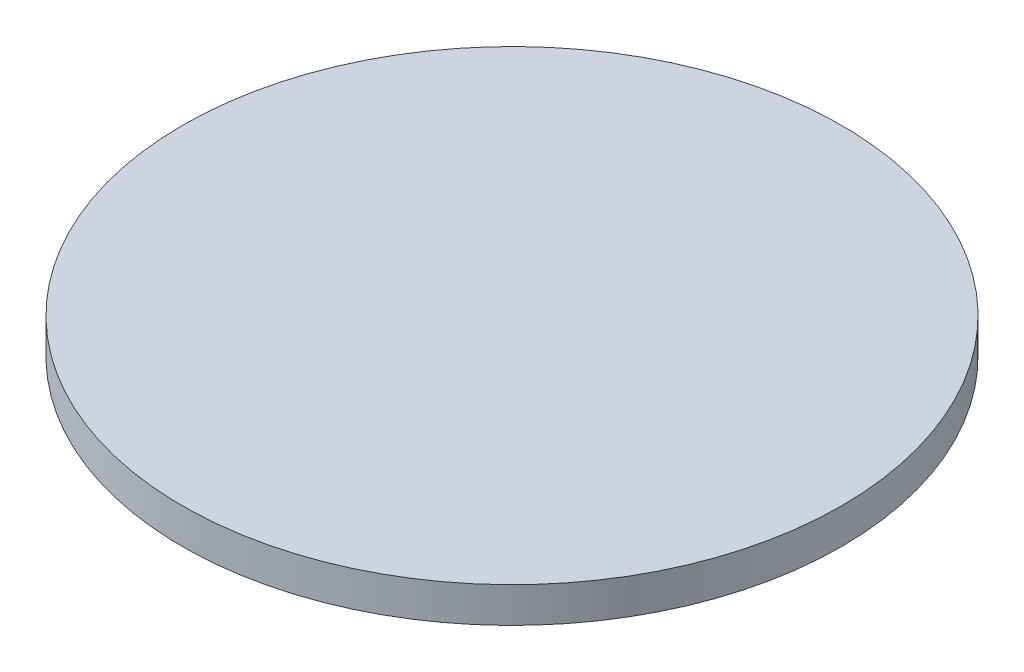
ISO-10303-21;
HEADER;
FILE_DESCRIPTION(('STEP AP214'),'2;1');
FILE_NAME('part.step','',(''),(''),'','','');
FILE_SCHEMA(('AUTOMOTIVE_DESIGN { 1 0 10303 214 1 1 1 1 }'));
ENDSEC;
DATA;
#1=APPLICATION_CONTEXT('core data for automotive mechanical design processes');
#2=APPLICATION_PROTOCOL_DEFINITION('international standard','automotive_design',2000,#1);
#3=PRODUCT_CONTEXT('',#1,'mechanical');
#4=PRODUCT('Part','Part','',(#3));
#5=PRODUCT_RELATED_PRODUCT_CATEGORY('part','',(#4));
#6=PRODUCT_DEFINITION_FORMATION('','',#4);
#7=PRODUCT_DEFINITION_CONTEXT('part definition',#1,'design');
#8=PRODUCT_DEFINITION('design','',#6,#7);
#9=PRODUCT_DEFINITION_SHAPE('','',#8);
#10=(LENGTH_UNIT() NAMED_UNIT(*) SI_UNIT(.MILLI.,.METRE.));
#11=(NAMED_UNIT(*) PLANE_ANGLE_UNIT() SI_UNIT($,.RADIAN.));
#12=(NAMED_UNIT(*) SI_UNIT($,.STERADIAN.) SOLID_ANGLE_UNIT());
#13=UNCERTAINTY_MEASURE_WITH_UNIT(LENGTH_MEASURE(1.E-05),#10,'distance_accuracy_value','');
#14=(GEOMETRIC_REPRESENTATION_CONTEXT(3) GLOBAL_UNCERTAINTY_ASSIGNED_CONTEXT((#13)) GLOBAL_UNIT_ASSIGNED_CONTEXT((#10,
#11,#12)) REPRESENTATION_CONTEXT('',''));
#15=CARTESIAN_POINT('',(0.,0.,0.));
#16=DIRECTION('',(0.,0.,1.));
#17=DIRECTION('',(1.,0.,0.));
#18=AXIS2_PLACEMENT_3D('',#15,#16,#17);
#19=CARTESIAN_POINT('',(0.,0.,0.));
#20=DIRECTION('',(0.,-1.,0.));
#21=DIRECTION('',(1.,0.,0.));
#22=AXIS2_PLACEMENT_3D('',#19,#20,#21);
#23=PLANE('',#22);
#24=CARTESIAN_POINT('',(0.,0.,0.));
#25=DIRECTION('',(0.,1.,0.));
#26=DIRECTION('',(-1.,0.,0.));
#27=AXIS2_PLACEMENT_3D('',#24,#25,#26);
#28=CIRCLE('',#27,36.5125);
#29=CARTESIAN_POINT('',(-36.5125,0.,0.));
#30=VERTEX_POINT('',#29);
#31=EDGE_CURVE('E10',#30,#30,#28,.T.);
#32=ORIENTED_EDGE('',*,*,#31,.F.);
#33=EDGE_LOOP('',(#32));
#34=FACE_BOUND('',#33,.T.);
#35=ADVANCED_FACE('F39',(#34),#23,.T.);
#36=CARTESIAN_POINT('',(0.,-1.5875,0.));
#37=DIRECTION('',(0.,-1.,0.));
#38=DIRECTION('',(1.,0.,0.));
#39=AXIS2_PLACEMENT_3D('',#36,#37,#38);
#40=CONICAL_SURFACE('',#39,38.1,0.785398163397445);
#41=ORIENTED_EDGE('',*,*,#31,.T.);
#42=EDGE_LOOP('',(#41));
#43=FACE_BOUND('',#42,.T.);
#44=CARTESIAN_POINT('',(0.,-1.5875,0.));
#45=DIRECTION('',(0.,1.,0.));
#46=DIRECTION('',(-1.,0.,0.));
#47=AXIS2_PLACEMENT_3D('',#44,#45,#46);
#48=CIRCLE('',#47,38.1);
#49=CARTESIAN_POINT('',(-38.1,-1.5875,0.));
#50=VERTEX_POINT('',#49);
#51=EDGE_CURVE('E46',#50,#50,#48,.T.);
#52=ORIENTED_EDGE('',*,*,#51,.F.);
#53=EDGE_LOOP('',(#52));
#54=FACE_BOUND('',#53,.T.);
#55=ADVANCED_FACE('F75',(#43,#54),#40,.F.);
#56=CARTESIAN_POINT('',(-38.1,-1.5875,0.));
#57=DIRECTION('',(0.,-1.,0.));
#58=DIRECTION('',(1.,0.,0.));
#59=AXIS2_PLACEMENT_3D('',#56,#57,#58);
#60=PLANE('',#59);
#61=ORIENTED_EDGE('',*,*,#51,.T.);
#62=EDGE_LOOP('',(#61));
#63=FACE_BOUND('',#62,.T.);
#64=CARTESIAN_POINT('',(0.,-1.5875,0.));
#65=DIRECTION('',(0.,1.,0.));
#66=DIRECTION('',(-1.,0.,0.));
#67=AXIS2_PLACEMENT_3D('',#64,#65,#66);
#68=CIRCLE('',#67,44.45);
#69=CARTESIAN_POINT('',(-44.45,-1.5875,0.));
#70=VERTEX_POINT('',#69);
#71=EDGE_CURVE('E51',#70,#70,#68,.T.);
#72=ORIENTED_EDGE('',*,*,#71,.F.);
#73=EDGE_LOOP('',(#72));
#74=FACE_BOUND('',#73,.T.);
#75=ADVANCED_FACE('F67',(#63,#74),#60,.T.);
#76=CARTESIAN_POINT('',(0.,3.175,0.));
#77=DIRECTION('',(0.,1.,0.));
#78=DIRECTION('',(-1.,0.,0.));
#79=AXIS2_PLACEMENT_3D('',#76,#77,#78);
#80=CYLINDRICAL_SURFACE('',#79,44.45);
#81=ORIENTED_EDGE('',*,*,#71,.T.);
#82=EDGE_LOOP('',(#81));
#83=FACE_BOUND('',#82,.T.);
#84=CARTESIAN_POINT('',(0.,3.175,0.));
#85=DIRECTION('',(0.,1.,0.));
#86=DIRECTION('',(-1.,0.,0.));
#87=AXIS2_PLACEMENT_3D('',#84,#85,#86);
#88=CIRCLE('',#87,44.45);
#89=CARTESIAN_POINT('',(-44.45,3.175,0.));
#90=VERTEX_POINT('',#89);
#91=EDGE_CURVE('E56',#90,#90,#88,.T.);
#92=ORIENTED_EDGE('',*,*,#91,.F.);
#93=EDGE_LOOP('',(#92));
#94=FACE_BOUND('',#93,.T.);
#95=ADVANCED_FACE('F65',(#83,#94),#80,.T.);
#96=CARTESIAN_POINT('',(-44.45,3.175,0.));
#97=DIRECTION('',(0.,1.,0.));
#98=DIRECTION('',(-1.,0.,0.));
#99=AXIS2_PLACEMENT_3D('',#96,#97,#98);
#100=PLANE('',#99);
#101=ORIENTED_EDGE('',*,*,#91,.T.);
#102=EDGE_LOOP('',(#101));
#103=FACE_BOUND('',#102,.T.);
#104=ADVANCED_FACE('F63',(#103),#100,.T.);
#105=CLOSED_SHELL('',(#35,#55,#75,#95,#104));
#106=MANIFOLD_SOLID_BREP('B2',#105);
#107=ADVANCED_BREP_SHAPE_REPRESENTATION('',(#18,#106),#14);
#108=SHAPE_DEFINITION_REPRESENTATION(#9,#107);
ENDSEC;
END-ISO-10303-21;
